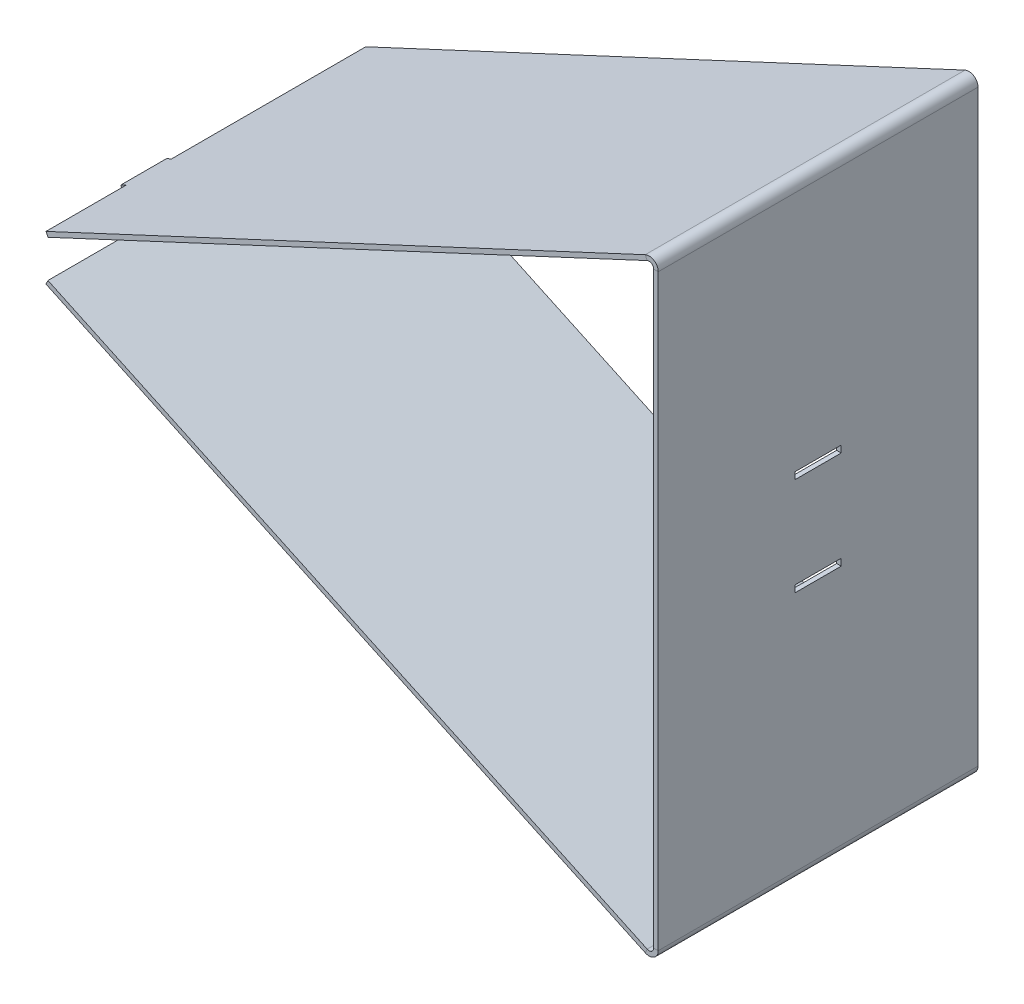
ISO-10303-21;
HEADER;
FILE_DESCRIPTION(('STEP AP214'),'2;1');
FILE_NAME('part.step','',(''),(''),'','','');
FILE_SCHEMA(('AUTOMOTIVE_DESIGN { 1 0 10303 214 1 1 1 1 }'));
ENDSEC;
DATA;
#1=APPLICATION_CONTEXT('core data for automotive mechanical design processes');
#2=APPLICATION_PROTOCOL_DEFINITION('international standard','automotive_design',2000,#1);
#3=PRODUCT_CONTEXT('',#1,'mechanical');
#4=PRODUCT('Part','Part','',(#3));
#5=PRODUCT_RELATED_PRODUCT_CATEGORY('part','',(#4));
#6=PRODUCT_DEFINITION_FORMATION('','',#4);
#7=PRODUCT_DEFINITION_CONTEXT('part definition',#1,'design');
#8=PRODUCT_DEFINITION('design','',#6,#7);
#9=PRODUCT_DEFINITION_SHAPE('','',#8);
#10=(LENGTH_UNIT() NAMED_UNIT(*) SI_UNIT(.MILLI.,.METRE.));
#11=(NAMED_UNIT(*) PLANE_ANGLE_UNIT() SI_UNIT($,.RADIAN.));
#12=(NAMED_UNIT(*) SI_UNIT($,.STERADIAN.) SOLID_ANGLE_UNIT());
#13=UNCERTAINTY_MEASURE_WITH_UNIT(LENGTH_MEASURE(1.E-05),#10,'distance_accuracy_value','');
#14=(GEOMETRIC_REPRESENTATION_CONTEXT(3) GLOBAL_UNCERTAINTY_ASSIGNED_CONTEXT((#13)) GLOBAL_UNIT_ASSIGNED_CONTEXT((#10,
#11,#12)) REPRESENTATION_CONTEXT('',''));
#15=CARTESIAN_POINT('',(0.,0.,0.));
#16=DIRECTION('',(0.,0.,1.));
#17=DIRECTION('',(1.,0.,0.));
#18=AXIS2_PLACEMENT_3D('',#15,#16,#17);
#19=CARTESIAN_POINT('',(372.91718723189,8.18738442592668,142.));
#20=DIRECTION('',(-0.906307787036641,-0.422618261740718,0.));
#21=DIRECTION('',(0.422618261740718,-0.906307787036641,0.));
#22=AXIS2_PLACEMENT_3D('',#19,#20,#21);
#23=PLANE('',#22);
#24=DIRECTION('',(0.,0.,-1.));
#25=VECTOR('',#24,1.);
#26=CARTESIAN_POINT('',(372.91718723189,8.18738442592668,142.));
#27=LINE('',#26,#25);
#28=CARTESIAN_POINT('',(372.91718723189,8.18738442592663,87.));
#29=VERTEX_POINT('',#28);
#30=CARTESIAN_POINT('',(372.91718723189,8.18738442592668,2.));
#31=VERTEX_POINT('',#30);
#32=EDGE_CURVE('E225',#29,#31,#27,.T.);
#33=ORIENTED_EDGE('',*,*,#32,.F.);
#34=DIRECTION('',(-0.422618261740699,0.90630778703665,0.));
#35=VECTOR('',#34,1.);
#36=CARTESIAN_POINT('',(372.91718723189,8.18738442592663,87.));
#37=LINE('',#36,#35);
#38=CARTESIAN_POINT('',(372.071950708408,9.99999999999999,87.));
#39=VERTEX_POINT('',#38);
#40=EDGE_CURVE('E232',#29,#39,#37,.T.);
#41=ORIENTED_EDGE('',*,*,#40,.T.);
#42=DIRECTION('',(0.,0.,-1.));
#43=VECTOR('',#42,1.);
#44=CARTESIAN_POINT('',(372.071950708408,9.99999999999999,142.));
#45=LINE('',#44,#43);
#46=CARTESIAN_POINT('',(372.071950708408,9.99999999999999,2.));
#47=VERTEX_POINT('',#46);
#48=EDGE_CURVE('E246',#39,#47,#45,.T.);
#49=ORIENTED_EDGE('',*,*,#48,.T.);
#50=DIRECTION('',(-0.422618261740718,0.906307787036641,0.));
#51=VECTOR('',#50,1.);
#52=CARTESIAN_POINT('',(372.91718723189,8.18738442592668,2.));
#53=LINE('',#52,#51);
#54=EDGE_CURVE('E240',#31,#47,#53,.T.);
#55=ORIENTED_EDGE('',*,*,#54,.F.);
#56=EDGE_LOOP('',(#33,#41,#49,#55));
#57=FACE_BOUND('',#56,.T.);
#58=ADVANCED_FACE('F36',(#57),#23,.T.);
#59=CARTESIAN_POINT('',(372.071950708408,-10.,142.));
#60=DIRECTION('',(-0.90630778703665,0.422618261740699,0.));
#61=DIRECTION('',(-0.422618261740699,-0.90630778703665,0.));
#62=AXIS2_PLACEMENT_3D('',#59,#60,#61);
#63=PLANE('',#62);
#64=DIRECTION('',(0.,0.,-1.));
#65=VECTOR('',#64,1.);
#66=CARTESIAN_POINT('',(372.91718723189,-8.18738442592671,142.));
#67=LINE('',#66,#65);
#68=CARTESIAN_POINT('',(372.91718723189,-8.18738442592671,142.));
#69=VERTEX_POINT('',#68);
#70=CARTESIAN_POINT('',(372.91718723189,-8.18738442592663,107.));
#71=VERTEX_POINT('',#70);
#72=EDGE_CURVE('E351',#69,#71,#67,.T.);
#73=ORIENTED_EDGE('',*,*,#72,.T.);
#74=DIRECTION('',(-0.422618261740699,-0.90630778703665,0.));
#75=VECTOR('',#74,1.);
#76=CARTESIAN_POINT('',(372.91718723189,-8.18738442592663,107.));
#77=LINE('',#76,#75);
#78=CARTESIAN_POINT('',(372.071950708408,-10.,107.));
#79=VERTEX_POINT('',#78);
#80=EDGE_CURVE('E408',#71,#79,#77,.T.);
#81=ORIENTED_EDGE('',*,*,#80,.T.);
#82=DIRECTION('',(0.,0.,-1.));
#83=VECTOR('',#82,1.);
#84=CARTESIAN_POINT('',(372.071950708408,-10.,142.));
#85=LINE('',#84,#83);
#86=CARTESIAN_POINT('',(372.071950708408,-10.,142.));
#87=VERTEX_POINT('',#86);
#88=EDGE_CURVE('E347',#87,#79,#85,.T.);
#89=ORIENTED_EDGE('',*,*,#88,.F.);
#90=DIRECTION('',(0.422618261740698,0.90630778703665,0.));
#91=VECTOR('',#90,1.);
#92=CARTESIAN_POINT('',(372.071950708408,-10.,142.));
#93=LINE('',#92,#91);
#94=EDGE_CURVE('E382',#87,#69,#93,.T.);
#95=ORIENTED_EDGE('',*,*,#94,.T.);
#96=EDGE_LOOP('',(#73,#81,#89,#95));
#97=FACE_BOUND('',#96,.T.);
#98=ADVANCED_FACE('F406',(#97),#63,.T.);
#99=CARTESIAN_POINT('',(634.44484272514,-132.346488839677,142.));
#100=DIRECTION('',(0.,0.,1.));
#101=DIRECTION('',(1.,0.,0.));
#102=AXIS2_PLACEMENT_3D('',#99,#100,#101);
#103=PLANE('',#102);
#104=DIRECTION('',(0.422618261740725,0.906307787036638,0.));
#105=VECTOR('',#104,1.);
#106=CARTESIAN_POINT('',(634.44484272514,-132.346488839677,142.));
#107=LINE('',#106,#105);
#108=CARTESIAN_POINT('',(634.44484272514,-132.346488839677,142.));
#109=VERTEX_POINT('',#108);
#110=CARTESIAN_POINT('',(635.290079248622,-130.533873265603,142.));
#111=VERTEX_POINT('',#110);
#112=EDGE_CURVE('E11',#109,#111,#107,.T.);
#113=ORIENTED_EDGE('',*,*,#112,.F.);
#114=CARTESIAN_POINT('',(636.135315772103,-128.72125769153,142.));
#115=DIRECTION('',(0.,0.,-1.));
#116=DIRECTION('',(-1.,0.,0.));
#117=AXIS2_PLACEMENT_3D('',#114,#115,#116);
#118=CIRCLE('',#117,4.);
#119=CARTESIAN_POINT('',(640.135315772103,-128.72125769153,142.));
#120=VERTEX_POINT('',#119);
#121=EDGE_CURVE('E281',#109,#120,#118,.F.);
#122=ORIENTED_EDGE('',*,*,#121,.T.);
#123=DIRECTION('',(1.,0.,0.));
#124=VECTOR('',#123,1.);
#125=CARTESIAN_POINT('',(638.135315772103,-128.72125769153,142.));
#126=LINE('',#125,#124);
#127=CARTESIAN_POINT('',(638.135315772103,-128.72125769153,142.));
#128=VERTEX_POINT('',#127);
#129=EDGE_CURVE('E44',#128,#120,#126,.T.);
#130=ORIENTED_EDGE('',*,*,#129,.F.);
#131=CARTESIAN_POINT('',(636.135315772103,-128.72125769153,142.));
#132=DIRECTION('',(0.,0.,1.));
#133=DIRECTION('',(1.,0.,0.));
#134=AXIS2_PLACEMENT_3D('',#131,#132,#133);
#135=CIRCLE('',#134,2.);
#136=EDGE_CURVE('E378',#111,#128,#135,.T.);
#137=ORIENTED_EDGE('',*,*,#136,.F.);
#138=EDGE_LOOP('',(#113,#122,#130,#137));
#139=FACE_BOUND('',#138,.T.);
#140=ADVANCED_FACE('F38',(#139),#103,.T.);
#141=CARTESIAN_POINT('',(638.135315772103,-128.72125769153,142.));
#142=DIRECTION('',(0.,0.,1.));
#143=DIRECTION('',(1.,0.,0.));
#144=AXIS2_PLACEMENT_3D('',#141,#142,#143);
#145=PLANE('',#144);
#146=DIRECTION('',(0.90630778703665,-0.4226182617407,0.));
#147=VECTOR('',#146,1.);
#148=CARTESIAN_POINT('',(372.071950708408,-10.,142.));
#149=LINE('',#148,#147);
#150=EDGE_CURVE('E286',#87,#109,#149,.T.);
#151=ORIENTED_EDGE('',*,*,#150,.T.);
#152=ORIENTED_EDGE('',*,*,#112,.T.);
#153=DIRECTION('',(0.90630778703665,-0.4226182617407,0.));
#154=VECTOR('',#153,1.);
#155=CARTESIAN_POINT('',(372.91718723189,-8.18738442592671,142.));
#156=LINE('',#155,#154);
#157=EDGE_CURVE('E380',#69,#111,#156,.T.);
#158=ORIENTED_EDGE('',*,*,#157,.F.);
#159=ORIENTED_EDGE('',*,*,#94,.F.);
#160=EDGE_LOOP('',(#151,#152,#158,#159));
#161=FACE_BOUND('',#160,.T.);
#162=ADVANCED_FACE('F393',(#161),#145,.T.);
#163=CARTESIAN_POINT('',(640.135315772103,-128.72125769153,2.));
#164=DIRECTION('',(0.,0.,-1.));
#165=DIRECTION('',(-1.,0.,0.));
#166=AXIS2_PLACEMENT_3D('',#163,#164,#165);
#167=PLANE('',#166);
#168=DIRECTION('',(-1.,0.,0.));
#169=VECTOR('',#168,1.);
#170=CARTESIAN_POINT('',(640.135315772103,-128.72125769153,2.));
#171=LINE('',#170,#169);
#172=CARTESIAN_POINT('',(640.135315772103,-128.72125769153,2.));
#173=VERTEX_POINT('',#172);
#174=CARTESIAN_POINT('',(638.135315772103,-128.72125769153,2.));
#175=VERTEX_POINT('',#174);
#176=EDGE_CURVE('E265',#173,#175,#171,.T.);
#177=ORIENTED_EDGE('',*,*,#176,.F.);
#178=CARTESIAN_POINT('',(636.135315772103,-128.72125769153,2.));
#179=DIRECTION('',(0.,0.,-1.));
#180=DIRECTION('',(-1.,0.,0.));
#181=AXIS2_PLACEMENT_3D('',#178,#179,#180);
#182=CIRCLE('',#181,4.);
#183=CARTESIAN_POINT('',(634.44484272514,-132.346488839677,2.));
#184=VERTEX_POINT('',#183);
#185=EDGE_CURVE('E293',#184,#173,#182,.F.);
#186=ORIENTED_EDGE('',*,*,#185,.F.);
#187=DIRECTION('',(-0.422618261740725,-0.906307787036638,0.));
#188=VECTOR('',#187,1.);
#189=CARTESIAN_POINT('',(635.290079248622,-130.533873265603,2.));
#190=LINE('',#189,#188);
#191=CARTESIAN_POINT('',(635.290079248622,-130.533873265603,2.));
#192=VERTEX_POINT('',#191);
#193=EDGE_CURVE('E263',#192,#184,#190,.T.);
#194=ORIENTED_EDGE('',*,*,#193,.F.);
#195=CARTESIAN_POINT('',(636.135315772103,-128.72125769153,2.));
#196=DIRECTION('',(0.,0.,1.));
#197=DIRECTION('',(1.,0.,0.));
#198=AXIS2_PLACEMENT_3D('',#195,#196,#197);
#199=CIRCLE('',#198,2.);
#200=EDGE_CURVE('E323',#192,#175,#199,.T.);
#201=ORIENTED_EDGE('',*,*,#200,.T.);
#202=EDGE_LOOP('',(#177,#186,#194,#201));
#203=FACE_BOUND('',#202,.T.);
#204=ADVANCED_FACE('F398',(#203),#167,.T.);
#205=CARTESIAN_POINT('',(635.290079248622,-130.533873265603,2.));
#206=DIRECTION('',(0.,0.,-1.));
#207=DIRECTION('',(-1.,0.,0.));
#208=AXIS2_PLACEMENT_3D('',#205,#206,#207);
#209=PLANE('',#208);
#210=DIRECTION('',(0.,1.,0.));
#211=VECTOR('',#210,1.);
#212=CARTESIAN_POINT('',(640.135315772103,-135.,2.));
#213=LINE('',#212,#211);
#214=CARTESIAN_POINT('',(640.135315772103,128.72125769153,2.));
#215=VERTEX_POINT('',#214);
#216=EDGE_CURVE('E336',#173,#215,#213,.T.);
#217=ORIENTED_EDGE('',*,*,#216,.F.);
#218=ORIENTED_EDGE('',*,*,#176,.T.);
#219=DIRECTION('',(0.,1.,0.));
#220=VECTOR('',#219,1.);
#221=CARTESIAN_POINT('',(638.135315772103,-135.,2.));
#222=LINE('',#221,#220);
#223=CARTESIAN_POINT('',(638.135315772103,128.72125769153,2.));
#224=VERTEX_POINT('',#223);
#225=EDGE_CURVE('E320',#175,#224,#222,.T.);
#226=ORIENTED_EDGE('',*,*,#225,.T.);
#227=DIRECTION('',(1.,0.,0.));
#228=VECTOR('',#227,1.);
#229=CARTESIAN_POINT('',(638.135315772103,128.72125769153,2.));
#230=LINE('',#229,#228);
#231=EDGE_CURVE('E255',#224,#215,#230,.T.);
#232=ORIENTED_EDGE('',*,*,#231,.T.);
#233=EDGE_LOOP('',(#217,#218,#226,#232));
#234=FACE_BOUND('',#233,.T.);
#235=ADVANCED_FACE('F372',(#234),#209,.T.);
#236=CARTESIAN_POINT('',(640.135315772103,128.72125769153,142.));
#237=DIRECTION('',(0.,0.,1.));
#238=DIRECTION('',(1.,0.,0.));
#239=AXIS2_PLACEMENT_3D('',#236,#237,#238);
#240=PLANE('',#239);
#241=DIRECTION('',(-1.,0.,0.));
#242=VECTOR('',#241,1.);
#243=CARTESIAN_POINT('',(640.135315772103,128.72125769153,142.));
#244=LINE('',#243,#242);
#245=CARTESIAN_POINT('',(640.135315772103,128.72125769153,142.));
#246=VERTEX_POINT('',#245);
#247=CARTESIAN_POINT('',(638.135315772103,128.72125769153,142.));
#248=VERTEX_POINT('',#247);
#249=EDGE_CURVE('E261',#246,#248,#244,.T.);
#250=ORIENTED_EDGE('',*,*,#249,.F.);
#251=CARTESIAN_POINT('',(636.135315772103,128.72125769153,142.));
#252=DIRECTION('',(0.,0.,-1.));
#253=DIRECTION('',(-1.,0.,0.));
#254=AXIS2_PLACEMENT_3D('',#251,#252,#253);
#255=CIRCLE('',#254,4.);
#256=CARTESIAN_POINT('',(634.44484272514,132.346488839677,142.));
#257=VERTEX_POINT('',#256);
#258=EDGE_CURVE('E303',#246,#257,#255,.F.);
#259=ORIENTED_EDGE('',*,*,#258,.T.);
#260=DIRECTION('',(-0.42261826174072,0.90630778703664,0.));
#261=VECTOR('',#260,1.);
#262=CARTESIAN_POINT('',(635.290079248622,130.533873265603,142.));
#263=LINE('',#262,#261);
#264=CARTESIAN_POINT('',(635.290079248622,130.533873265603,142.));
#265=VERTEX_POINT('',#264);
#266=EDGE_CURVE('E259',#265,#257,#263,.T.);
#267=ORIENTED_EDGE('',*,*,#266,.F.);
#268=CARTESIAN_POINT('',(636.135315772103,128.72125769153,142.));
#269=DIRECTION('',(0.,0.,1.));
#270=DIRECTION('',(1.,0.,0.));
#271=AXIS2_PLACEMENT_3D('',#268,#269,#270);
#272=CIRCLE('',#271,2.);
#273=EDGE_CURVE('E384',#248,#265,#272,.T.);
#274=ORIENTED_EDGE('',*,*,#273,.F.);
#275=EDGE_LOOP('',(#250,#259,#267,#274));
#276=FACE_BOUND('',#275,.T.);
#277=ADVANCED_FACE('F442',(#276),#240,.T.);
#278=CARTESIAN_POINT('',(635.290079248622,130.533873265603,142.));
#279=DIRECTION('',(0.,0.,1.));
#280=DIRECTION('',(1.,0.,0.));
#281=AXIS2_PLACEMENT_3D('',#278,#279,#280);
#282=PLANE('',#281);
#283=DIRECTION('',(0.,1.,0.));
#284=VECTOR('',#283,1.);
#285=CARTESIAN_POINT('',(640.135315772103,-135.,142.));
#286=LINE('',#285,#284);
#287=EDGE_CURVE('E272',#120,#246,#286,.T.);
#288=ORIENTED_EDGE('',*,*,#287,.T.);
#289=ORIENTED_EDGE('',*,*,#249,.T.);
#290=DIRECTION('',(0.,1.,0.));
#291=VECTOR('',#290,1.);
#292=CARTESIAN_POINT('',(638.135315772103,-135.,142.));
#293=LINE('',#292,#291);
#294=EDGE_CURVE('E275',#128,#248,#293,.T.);
#295=ORIENTED_EDGE('',*,*,#294,.F.);
#296=ORIENTED_EDGE('',*,*,#129,.T.);
#297=EDGE_LOOP('',(#288,#289,#295,#296));
#298=FACE_BOUND('',#297,.T.);
#299=ADVANCED_FACE('F270',(#298),#282,.T.);
#300=CARTESIAN_POINT('',(634.44484272514,132.346488839677,2.));
#301=DIRECTION('',(0.,0.,-1.));
#302=DIRECTION('',(-1.,0.,0.));
#303=AXIS2_PLACEMENT_3D('',#300,#301,#302);
#304=PLANE('',#303);
#305=DIRECTION('',(0.42261826174072,-0.90630778703664,0.));
#306=VECTOR('',#305,1.);
#307=CARTESIAN_POINT('',(634.44484272514,132.346488839677,2.));
#308=LINE('',#307,#306);
#309=CARTESIAN_POINT('',(634.44484272514,132.346488839677,2.));
#310=VERTEX_POINT('',#309);
#311=CARTESIAN_POINT('',(635.290079248622,130.533873265603,2.));
#312=VERTEX_POINT('',#311);
#313=EDGE_CURVE('E257',#310,#312,#308,.T.);
#314=ORIENTED_EDGE('',*,*,#313,.F.);
#315=CARTESIAN_POINT('',(636.135315772103,128.72125769153,2.));
#316=DIRECTION('',(0.,0.,-1.));
#317=DIRECTION('',(-1.,0.,0.));
#318=AXIS2_PLACEMENT_3D('',#315,#316,#317);
#319=CIRCLE('',#318,4.);
#320=EDGE_CURVE('E338',#215,#310,#319,.F.);
#321=ORIENTED_EDGE('',*,*,#320,.F.);
#322=ORIENTED_EDGE('',*,*,#231,.F.);
#323=CARTESIAN_POINT('',(636.135315772103,128.72125769153,2.));
#324=DIRECTION('',(0.,0.,1.));
#325=DIRECTION('',(1.,0.,0.));
#326=AXIS2_PLACEMENT_3D('',#323,#324,#325);
#327=CIRCLE('',#326,2.);
#328=EDGE_CURVE('E317',#224,#312,#327,.T.);
#329=ORIENTED_EDGE('',*,*,#328,.T.);
#330=EDGE_LOOP('',(#314,#321,#322,#329));
#331=FACE_BOUND('',#330,.T.);
#332=ADVANCED_FACE('F576',(#331),#304,.T.);
#333=CARTESIAN_POINT('',(638.135315772103,128.72125769153,2.));
#334=DIRECTION('',(0.,0.,-1.));
#335=DIRECTION('',(-1.,0.,0.));
#336=AXIS2_PLACEMENT_3D('',#333,#334,#335);
#337=PLANE('',#336);
#338=DIRECTION('',(-0.90630778703665,-0.4226182617407,0.));
#339=VECTOR('',#338,1.);
#340=CARTESIAN_POINT('',(640.135315772103,135.,2.));
#341=LINE('',#340,#339);
#342=EDGE_CURVE('E310',#310,#47,#341,.T.);
#343=ORIENTED_EDGE('',*,*,#342,.F.);
#344=ORIENTED_EDGE('',*,*,#313,.T.);
#345=DIRECTION('',(-0.90630778703665,-0.4226182617407,0.));
#346=VECTOR('',#345,1.);
#347=CARTESIAN_POINT('',(640.980552295585,133.187384425927,2.));
#348=LINE('',#347,#346);
#349=EDGE_CURVE('E315',#312,#31,#348,.T.);
#350=ORIENTED_EDGE('',*,*,#349,.T.);
#351=ORIENTED_EDGE('',*,*,#54,.T.);
#352=EDGE_LOOP('',(#343,#344,#350,#351));
#353=FACE_BOUND('',#352,.T.);
#354=ADVANCED_FACE('F571',(#353),#337,.T.);
#355=CARTESIAN_POINT('',(640.135315772103,135.,142.));
#356=DIRECTION('',(0.4226182617407,-0.90630778703665,0.));
#357=DIRECTION('',(0.90630778703665,0.4226182617407,0.));
#358=AXIS2_PLACEMENT_3D('',#355,#356,#357);
#359=PLANE('',#358);
#360=ORIENTED_EDGE('',*,*,#342,.T.);
#361=ORIENTED_EDGE('',*,*,#48,.F.);
#362=DIRECTION('',(0.906307787036651,0.422618261740697,0.));
#363=VECTOR('',#362,1.);
#364=CARTESIAN_POINT('',(372.071950708408,9.99999999999993,87.));
#365=LINE('',#364,#363);
#366=CARTESIAN_POINT('',(369.806181240817,8.94345434564819,87.));
#367=VERTEX_POINT('',#366);
#368=EDGE_CURVE('E51',#367,#39,#365,.T.);
#369=ORIENTED_EDGE('',*,*,#368,.F.);
#370=DIRECTION('',(0.,0.,-1.));
#371=VECTOR('',#370,1.);
#372=CARTESIAN_POINT('',(369.806181240817,8.94345434564819,107.));
#373=LINE('',#372,#371);
#374=CARTESIAN_POINT('',(369.806181240817,8.94345434564819,107.));
#375=VERTEX_POINT('',#374);
#376=EDGE_CURVE('E468',#375,#367,#373,.T.);
#377=ORIENTED_EDGE('',*,*,#376,.F.);
#378=DIRECTION('',(-0.906307787036651,-0.422618261740697,0.));
#379=VECTOR('',#378,1.);
#380=CARTESIAN_POINT('',(372.071950708408,9.99999999999993,107.));
#381=LINE('',#380,#379);
#382=CARTESIAN_POINT('',(372.071950708408,9.99999999999993,107.));
#383=VERTEX_POINT('',#382);
#384=EDGE_CURVE('E230',#383,#375,#381,.T.);
#385=ORIENTED_EDGE('',*,*,#384,.F.);
#386=CARTESIAN_POINT('',(372.071950708408,9.99999999999999,142.));
#387=VERTEX_POINT('',#386);
#388=EDGE_CURVE('E252',#387,#383,#45,.T.);
#389=ORIENTED_EDGE('',*,*,#388,.F.);
#390=DIRECTION('',(-0.90630778703665,-0.4226182617407,0.));
#391=VECTOR('',#390,1.);
#392=CARTESIAN_POINT('',(640.135315772103,135.,142.));
#393=LINE('',#392,#391);
#394=EDGE_CURVE('E341',#257,#387,#393,.T.);
#395=ORIENTED_EDGE('',*,*,#394,.F.);
#396=DIRECTION('',(0.,0.,-1.));
#397=VECTOR('',#396,1.);
#398=CARTESIAN_POINT('',(634.44484272514,132.346488839677,142.));
#399=LINE('',#398,#397);
#400=EDGE_CURVE('E306',#257,#310,#399,.T.);
#401=ORIENTED_EDGE('',*,*,#400,.T.);
#402=EDGE_LOOP('',(#360,#361,#369,#377,#385,#389,#395,#401));
#403=FACE_BOUND('',#402,.T.);
#404=ADVANCED_FACE('F566',(#403),#359,.F.);
#405=DIRECTION('',(-0.422618261740699,0.90630778703665,0.));
#406=VECTOR('',#405,1.);
#407=CARTESIAN_POINT('',(372.91718723189,8.18738442592663,107.));
#408=LINE('',#407,#406);
#409=CARTESIAN_POINT('',(372.91718723189,8.18738442592663,107.));
#410=VERTEX_POINT('',#409);
#411=EDGE_CURVE('E454',#410,#383,#408,.T.);
#412=ORIENTED_EDGE('',*,*,#411,.F.);
#413=CARTESIAN_POINT('',(372.91718723189,8.18738442592668,142.));
#414=VERTEX_POINT('',#413);
#415=EDGE_CURVE('E242',#414,#410,#27,.T.);
#416=ORIENTED_EDGE('',*,*,#415,.F.);
#417=DIRECTION('',(-0.422618261740718,0.906307787036641,0.));
#418=VECTOR('',#417,1.);
#419=CARTESIAN_POINT('',(372.91718723189,8.18738442592668,142.));
#420=LINE('',#419,#418);
#421=EDGE_CURVE('E436',#414,#387,#420,.T.);
#422=ORIENTED_EDGE('',*,*,#421,.T.);
#423=ORIENTED_EDGE('',*,*,#388,.T.);
#424=EDGE_LOOP('',(#412,#416,#422,#423));
#425=FACE_BOUND('',#424,.T.);
#426=ADVANCED_FACE('F452',(#425),#23,.T.);
#427=CARTESIAN_POINT('',(640.980552295585,133.187384425927,142.));
#428=DIRECTION('',(0.4226182617407,-0.90630778703665,0.));
#429=DIRECTION('',(0.90630778703665,0.4226182617407,0.));
#430=AXIS2_PLACEMENT_3D('',#427,#428,#429);
#431=PLANE('',#430);
#432=ORIENTED_EDGE('',*,*,#349,.F.);
#433=DIRECTION('',(0.,0.,-1.));
#434=VECTOR('',#433,1.);
#435=CARTESIAN_POINT('',(635.290079248622,130.533873265603,142.));
#436=LINE('',#435,#434);
#437=EDGE_CURVE('E243',#265,#312,#436,.T.);
#438=ORIENTED_EDGE('',*,*,#437,.F.);
#439=DIRECTION('',(-0.90630778703665,-0.4226182617407,0.));
#440=VECTOR('',#439,1.);
#441=CARTESIAN_POINT('',(640.980552295585,133.187384425927,142.));
#442=LINE('',#441,#440);
#443=EDGE_CURVE('E439',#265,#414,#442,.T.);
#444=ORIENTED_EDGE('',*,*,#443,.T.);
#445=ORIENTED_EDGE('',*,*,#415,.T.);
#446=DIRECTION('',(-0.906307787036651,-0.422618261740697,0.));
#447=VECTOR('',#446,1.);
#448=CARTESIAN_POINT('',(372.91718723189,8.18738442592663,107.));
#449=LINE('',#448,#447);
#450=CARTESIAN_POINT('',(370.651417764298,7.13083877157489,107.));
#451=VERTEX_POINT('',#450);
#452=EDGE_CURVE('E237',#410,#451,#449,.T.);
#453=ORIENTED_EDGE('',*,*,#452,.T.);
#454=DIRECTION('',(0.,0.,-1.));
#455=VECTOR('',#454,1.);
#456=CARTESIAN_POINT('',(370.651417764298,7.13083877157489,107.));
#457=LINE('',#456,#455);
#458=CARTESIAN_POINT('',(370.651417764298,7.13083877157489,87.));
#459=VERTEX_POINT('',#458);
#460=EDGE_CURVE('E228',#451,#459,#457,.T.);
#461=ORIENTED_EDGE('',*,*,#460,.T.);
#462=DIRECTION('',(0.906307787036651,0.422618261740697,0.));
#463=VECTOR('',#462,1.);
#464=CARTESIAN_POINT('',(372.91718723189,8.18738442592663,87.));
#465=LINE('',#464,#463);
#466=EDGE_CURVE('E221',#459,#29,#465,.T.);
#467=ORIENTED_EDGE('',*,*,#466,.T.);
#468=ORIENTED_EDGE('',*,*,#32,.T.);
#469=EDGE_LOOP('',(#432,#438,#444,#445,#453,#461,#467,#468));
#470=FACE_BOUND('',#469,.T.);
#471=ADVANCED_FACE('F223',(#470),#431,.T.);
#472=CARTESIAN_POINT('',(636.135315772103,128.72125769153,142.));
#473=DIRECTION('',(0.,0.,-1.));
#474=DIRECTION('',(-1.,0.,0.));
#475=AXIS2_PLACEMENT_3D('',#472,#473,#474);
#476=CYLINDRICAL_SURFACE('',#475,2.);
#477=ORIENTED_EDGE('',*,*,#328,.F.);
#478=DIRECTION('',(0.,0.,-1.));
#479=VECTOR('',#478,1.);
#480=CARTESIAN_POINT('',(638.135315772103,128.72125769153,142.));
#481=LINE('',#480,#479);
#482=EDGE_CURVE('E248',#248,#224,#481,.T.);
#483=ORIENTED_EDGE('',*,*,#482,.F.);
#484=ORIENTED_EDGE('',*,*,#273,.T.);
#485=ORIENTED_EDGE('',*,*,#437,.T.);
#486=EDGE_LOOP('',(#477,#483,#484,#485));
#487=FACE_BOUND('',#486,.T.);
#488=ADVANCED_FACE('F368',(#487),#476,.F.);
#489=CARTESIAN_POINT('',(638.135315772103,-135.,142.));
#490=DIRECTION('',(-1.,0.,0.));
#491=DIRECTION('',(0.,0.,1.));
#492=AXIS2_PLACEMENT_3D('',#489,#490,#491);
#493=PLANE('',#492);
#494=DIRECTION('',(0.,-1.,0.));
#495=VECTOR('',#494,1.);
#496=CARTESIAN_POINT('',(638.135315772103,-19.9534570333156,82.1));
#497=LINE('',#496,#495);
#498=CARTESIAN_POINT('',(638.135315772103,-19.9534570333156,82.1));
#499=VERTEX_POINT('',#498);
#500=CARTESIAN_POINT('',(638.135315772103,-22.9534570333156,82.1));
#501=VERTEX_POINT('',#500);
#502=EDGE_CURVE('E474',#499,#501,#497,.T.);
#503=ORIENTED_EDGE('',*,*,#502,.T.);
#504=DIRECTION('',(0.,0.,-1.));
#505=VECTOR('',#504,1.);
#506=CARTESIAN_POINT('',(638.135315772103,-22.9534570333156,82.1));
#507=LINE('',#506,#505);
#508=CARTESIAN_POINT('',(638.135315772103,-22.9534570333156,61.9));
#509=VERTEX_POINT('',#508);
#510=EDGE_CURVE('E477',#501,#509,#507,.T.);
#511=ORIENTED_EDGE('',*,*,#510,.T.);
#512=DIRECTION('',(0.,1.,0.));
#513=VECTOR('',#512,1.);
#514=CARTESIAN_POINT('',(638.135315772103,-19.9534570333156,61.9));
#515=LINE('',#514,#513);
#516=CARTESIAN_POINT('',(638.135315772103,-19.9534570333156,61.9));
#517=VERTEX_POINT('',#516);
#518=EDGE_CURVE('E59',#509,#517,#515,.T.);
#519=ORIENTED_EDGE('',*,*,#518,.T.);
#520=DIRECTION('',(0.,0.,1.));
#521=VECTOR('',#520,1.);
#522=CARTESIAN_POINT('',(638.135315772103,-19.9534570333156,82.1));
#523=LINE('',#522,#521);
#524=EDGE_CURVE('E482',#517,#499,#523,.T.);
#525=ORIENTED_EDGE('',*,*,#524,.T.);
#526=EDGE_LOOP('',(#503,#511,#519,#525));
#527=FACE_BOUND('',#526,.T.);
#528=DIRECTION('',(0.,0.,-1.));
#529=VECTOR('',#528,1.);
#530=CARTESIAN_POINT('',(638.135315772103,19.9534570333156,82.1));
#531=LINE('',#530,#529);
#532=CARTESIAN_POINT('',(638.135315772103,19.9534570333156,82.1));
#533=VERTEX_POINT('',#532);
#534=CARTESIAN_POINT('',(638.135315772103,19.9534570333156,61.9));
#535=VERTEX_POINT('',#534);
#536=EDGE_CURVE('E502',#533,#535,#531,.T.);
#537=ORIENTED_EDGE('',*,*,#536,.T.);
#538=DIRECTION('',(0.,1.,0.));
#539=VECTOR('',#538,1.);
#540=CARTESIAN_POINT('',(638.135315772103,19.9534570333156,61.9));
#541=LINE('',#540,#539);
#542=CARTESIAN_POINT('',(638.135315772103,22.9534570333156,61.9));
#543=VERTEX_POINT('',#542);
#544=EDGE_CURVE('E505',#535,#543,#541,.T.);
#545=ORIENTED_EDGE('',*,*,#544,.T.);
#546=DIRECTION('',(0.,0.,1.));
#547=VECTOR('',#546,1.);
#548=CARTESIAN_POINT('',(638.135315772103,22.9534570333156,82.1));
#549=LINE('',#548,#547);
#550=CARTESIAN_POINT('',(638.135315772103,22.9534570333156,82.1));
#551=VERTEX_POINT('',#550);
#552=EDGE_CURVE('E509',#543,#551,#549,.T.);
#553=ORIENTED_EDGE('',*,*,#552,.T.);
#554=DIRECTION('',(0.,-1.,0.));
#555=VECTOR('',#554,1.);
#556=CARTESIAN_POINT('',(638.135315772103,19.9534570333156,82.1));
#557=LINE('',#556,#555);
#558=EDGE_CURVE('E512',#551,#533,#557,.T.);
#559=ORIENTED_EDGE('',*,*,#558,.T.);
#560=EDGE_LOOP('',(#537,#545,#553,#559));
#561=FACE_BOUND('',#560,.T.);
#562=ORIENTED_EDGE('',*,*,#225,.F.);
#563=DIRECTION('',(0.,0.,-1.));
#564=VECTOR('',#563,1.);
#565=CARTESIAN_POINT('',(638.135315772103,-128.72125769153,142.));
#566=LINE('',#565,#564);
#567=EDGE_CURVE('E357',#128,#175,#566,.T.);
#568=ORIENTED_EDGE('',*,*,#567,.F.);
#569=ORIENTED_EDGE('',*,*,#294,.T.);
#570=ORIENTED_EDGE('',*,*,#482,.T.);
#571=EDGE_LOOP('',(#562,#568,#569,#570));
#572=FACE_BOUND('',#571,.T.);
#573=ADVANCED_FACE('F364',(#527,#561,#572),#493,.T.);
#574=CARTESIAN_POINT('',(636.135315772103,-128.72125769153,142.));
#575=DIRECTION('',(0.,0.,-1.));
#576=DIRECTION('',(-1.,0.,0.));
#577=AXIS2_PLACEMENT_3D('',#574,#575,#576);
#578=CYLINDRICAL_SURFACE('',#577,2.);
#579=ORIENTED_EDGE('',*,*,#200,.F.);
#580=DIRECTION('',(0.,0.,-1.));
#581=VECTOR('',#580,1.);
#582=CARTESIAN_POINT('',(635.290079248622,-130.533873265603,142.));
#583=LINE('',#582,#581);
#584=EDGE_CURVE('E354',#111,#192,#583,.T.);
#585=ORIENTED_EDGE('',*,*,#584,.F.);
#586=ORIENTED_EDGE('',*,*,#136,.T.);
#587=ORIENTED_EDGE('',*,*,#567,.T.);
#588=EDGE_LOOP('',(#579,#585,#586,#587));
#589=FACE_BOUND('',#588,.T.);
#590=ADVANCED_FACE('F376',(#589),#578,.F.);
#591=CARTESIAN_POINT('',(372.91718723189,-8.18738442592671,142.));
#592=DIRECTION('',(0.4226182617407,0.90630778703665,0.));
#593=DIRECTION('',(-0.90630778703665,0.4226182617407,0.));
#594=AXIS2_PLACEMENT_3D('',#591,#592,#593);
#595=PLANE('',#594);
#596=DIRECTION('',(0.90630778703665,-0.4226182617407,0.));
#597=VECTOR('',#596,1.);
#598=CARTESIAN_POINT('',(372.91718723189,-8.18738442592671,2.));
#599=LINE('',#598,#597);
#600=CARTESIAN_POINT('',(372.91718723189,-8.18738442592671,2.));
#601=VERTEX_POINT('',#600);
#602=EDGE_CURVE('E326',#601,#192,#599,.T.);
#603=ORIENTED_EDGE('',*,*,#602,.F.);
#604=CARTESIAN_POINT('',(372.91718723189,-8.18738442592663,87.));
#605=VERTEX_POINT('',#604);
#606=EDGE_CURVE('E350',#605,#601,#67,.T.);
#607=ORIENTED_EDGE('',*,*,#606,.F.);
#608=DIRECTION('',(0.906307787036651,-0.422618261740697,0.));
#609=VECTOR('',#608,1.);
#610=CARTESIAN_POINT('',(372.91718723189,-8.18738442592663,87.));
#611=LINE('',#610,#609);
#612=CARTESIAN_POINT('',(370.651417764298,-7.13083877157489,87.));
#613=VERTEX_POINT('',#612);
#614=EDGE_CURVE('E424',#613,#605,#611,.T.);
#615=ORIENTED_EDGE('',*,*,#614,.F.);
#616=DIRECTION('',(0.,0.,-1.));
#617=VECTOR('',#616,1.);
#618=CARTESIAN_POINT('',(370.651417764298,-7.13083877157489,107.));
#619=LINE('',#618,#617);
#620=CARTESIAN_POINT('',(370.651417764298,-7.13083877157489,107.));
#621=VERTEX_POINT('',#620);
#622=EDGE_CURVE('E533',#621,#613,#619,.T.);
#623=ORIENTED_EDGE('',*,*,#622,.F.);
#624=DIRECTION('',(-0.906307787036651,0.422618261740697,0.));
#625=VECTOR('',#624,1.);
#626=CARTESIAN_POINT('',(372.91718723189,-8.18738442592663,107.));
#627=LINE('',#626,#625);
#628=EDGE_CURVE('E428',#71,#621,#627,.T.);
#629=ORIENTED_EDGE('',*,*,#628,.F.);
#630=ORIENTED_EDGE('',*,*,#72,.F.);
#631=ORIENTED_EDGE('',*,*,#157,.T.);
#632=ORIENTED_EDGE('',*,*,#584,.T.);
#633=EDGE_LOOP('',(#603,#607,#615,#623,#629,#630,#631,#632));
#634=FACE_BOUND('',#633,.T.);
#635=ADVANCED_FACE('F402',(#634),#595,.T.);
#636=DIRECTION('',(-0.422618261740699,-0.90630778703665,0.));
#637=VECTOR('',#636,1.);
#638=CARTESIAN_POINT('',(372.91718723189,-8.18738442592663,87.));
#639=LINE('',#638,#637);
#640=CARTESIAN_POINT('',(372.071950708408,-9.99999999999993,87.));
#641=VERTEX_POINT('',#640);
#642=EDGE_CURVE('E313',#605,#641,#639,.T.);
#643=ORIENTED_EDGE('',*,*,#642,.F.);
#644=ORIENTED_EDGE('',*,*,#606,.T.);
#645=DIRECTION('',(0.422618261740698,0.90630778703665,0.));
#646=VECTOR('',#645,1.);
#647=CARTESIAN_POINT('',(372.071950708408,-10.,2.));
#648=LINE('',#647,#646);
#649=CARTESIAN_POINT('',(372.071950708408,-10.,2.));
#650=VERTEX_POINT('',#649);
#651=EDGE_CURVE('E329',#650,#601,#648,.T.);
#652=ORIENTED_EDGE('',*,*,#651,.F.);
#653=EDGE_CURVE('E346',#641,#650,#85,.T.);
#654=ORIENTED_EDGE('',*,*,#653,.F.);
#655=EDGE_LOOP('',(#643,#644,#652,#654));
#656=FACE_BOUND('',#655,.T.);
#657=ADVANCED_FACE('F543',(#656),#63,.T.);
#658=CARTESIAN_POINT('',(372.071950708408,-10.,142.));
#659=DIRECTION('',(0.4226182617407,0.90630778703665,0.));
#660=DIRECTION('',(-0.90630778703665,0.4226182617407,0.));
#661=AXIS2_PLACEMENT_3D('',#658,#659,#660);
#662=PLANE('',#661);
#663=DIRECTION('',(0.90630778703665,-0.4226182617407,0.));
#664=VECTOR('',#663,1.);
#665=CARTESIAN_POINT('',(372.071950708408,-10.,2.));
#666=LINE('',#665,#664);
#667=EDGE_CURVE('E332',#650,#184,#666,.T.);
#668=ORIENTED_EDGE('',*,*,#667,.T.);
#669=DIRECTION('',(0.,0.,-1.));
#670=VECTOR('',#669,1.);
#671=CARTESIAN_POINT('',(634.44484272514,-132.346488839677,142.));
#672=LINE('',#671,#670);
#673=EDGE_CURVE('E297',#109,#184,#672,.T.);
#674=ORIENTED_EDGE('',*,*,#673,.F.);
#675=ORIENTED_EDGE('',*,*,#150,.F.);
#676=ORIENTED_EDGE('',*,*,#88,.T.);
#677=DIRECTION('',(-0.906307787036651,0.422618261740697,0.));
#678=VECTOR('',#677,1.);
#679=CARTESIAN_POINT('',(372.071950708408,-9.99999999999993,107.));
#680=LINE('',#679,#678);
#681=CARTESIAN_POINT('',(369.806181240817,-8.94345434564819,107.));
#682=VERTEX_POINT('',#681);
#683=EDGE_CURVE('E411',#79,#682,#680,.T.);
#684=ORIENTED_EDGE('',*,*,#683,.T.);
#685=DIRECTION('',(0.,0.,-1.));
#686=VECTOR('',#685,1.);
#687=CARTESIAN_POINT('',(369.806181240817,-8.94345434564819,107.));
#688=LINE('',#687,#686);
#689=CARTESIAN_POINT('',(369.806181240817,-8.94345434564819,87.));
#690=VERTEX_POINT('',#689);
#691=EDGE_CURVE('E414',#682,#690,#688,.T.);
#692=ORIENTED_EDGE('',*,*,#691,.T.);
#693=DIRECTION('',(0.906307787036651,-0.422618261740697,0.));
#694=VECTOR('',#693,1.);
#695=CARTESIAN_POINT('',(372.071950708408,-9.99999999999993,87.));
#696=LINE('',#695,#694);
#697=EDGE_CURVE('E419',#690,#641,#696,.T.);
#698=ORIENTED_EDGE('',*,*,#697,.T.);
#699=ORIENTED_EDGE('',*,*,#653,.T.);
#700=EDGE_LOOP('',(#668,#674,#675,#676,#684,#692,#698,#699));
#701=FACE_BOUND('',#700,.T.);
#702=ADVANCED_FACE('F396',(#701),#662,.F.);
#703=CARTESIAN_POINT('',(636.135315772103,-128.72125769153,142.));
#704=DIRECTION('',(0.,0.,-1.));
#705=DIRECTION('',(-1.,0.,0.));
#706=AXIS2_PLACEMENT_3D('',#703,#704,#705);
#707=CYLINDRICAL_SURFACE('',#706,4.);
#708=ORIENTED_EDGE('',*,*,#185,.T.);
#709=DIRECTION('',(0.,0.,-1.));
#710=VECTOR('',#709,1.);
#711=CARTESIAN_POINT('',(640.135315772103,-128.72125769153,142.));
#712=LINE('',#711,#710);
#713=EDGE_CURVE('E290',#120,#173,#712,.T.);
#714=ORIENTED_EDGE('',*,*,#713,.F.);
#715=ORIENTED_EDGE('',*,*,#121,.F.);
#716=ORIENTED_EDGE('',*,*,#673,.T.);
#717=EDGE_LOOP('',(#708,#714,#715,#716));
#718=FACE_BOUND('',#717,.T.);
#719=ADVANCED_FACE('F291',(#718),#707,.T.);
#720=CARTESIAN_POINT('',(640.135315772103,-135.,142.));
#721=DIRECTION('',(-1.,0.,0.));
#722=DIRECTION('',(0.,0.,1.));
#723=AXIS2_PLACEMENT_3D('',#720,#721,#722);
#724=PLANE('',#723);
#725=DIRECTION('',(0.,0.,-1.));
#726=VECTOR('',#725,1.);
#727=CARTESIAN_POINT('',(640.135315772103,-22.9534570333156,82.1));
#728=LINE('',#727,#726);
#729=CARTESIAN_POINT('',(640.135315772103,-22.9534570333156,82.1));
#730=VERTEX_POINT('',#729);
#731=CARTESIAN_POINT('',(640.135315772103,-22.9534570333156,61.9));
#732=VERTEX_POINT('',#731);
#733=EDGE_CURVE('E488',#730,#732,#728,.T.);
#734=ORIENTED_EDGE('',*,*,#733,.F.);
#735=DIRECTION('',(0.,-1.,0.));
#736=VECTOR('',#735,1.);
#737=CARTESIAN_POINT('',(640.135315772103,-19.9534570333156,82.1));
#738=LINE('',#737,#736);
#739=CARTESIAN_POINT('',(640.135315772103,-19.9534570333156,82.1));
#740=VERTEX_POINT('',#739);
#741=EDGE_CURVE('E486',#740,#730,#738,.T.);
#742=ORIENTED_EDGE('',*,*,#741,.F.);
#743=DIRECTION('',(0.,0.,1.));
#744=VECTOR('',#743,1.);
#745=CARTESIAN_POINT('',(640.135315772103,-19.9534570333156,82.1));
#746=LINE('',#745,#744);
#747=CARTESIAN_POINT('',(640.135315772103,-19.9534570333156,61.9));
#748=VERTEX_POINT('',#747);
#749=EDGE_CURVE('E478',#748,#740,#746,.T.);
#750=ORIENTED_EDGE('',*,*,#749,.F.);
#751=DIRECTION('',(0.,1.,0.));
#752=VECTOR('',#751,1.);
#753=CARTESIAN_POINT('',(640.135315772103,-19.9534570333156,61.9));
#754=LINE('',#753,#752);
#755=EDGE_CURVE('E492',#732,#748,#754,.T.);
#756=ORIENTED_EDGE('',*,*,#755,.F.);
#757=EDGE_LOOP('',(#734,#742,#750,#756));
#758=FACE_BOUND('',#757,.T.);
#759=DIRECTION('',(0.,1.,0.));
#760=VECTOR('',#759,1.);
#761=CARTESIAN_POINT('',(640.135315772103,19.9534570333156,61.9));
#762=LINE('',#761,#760);
#763=CARTESIAN_POINT('',(640.135315772103,19.9534570333156,61.9));
#764=VERTEX_POINT('',#763);
#765=CARTESIAN_POINT('',(640.135315772103,22.9534570333156,61.9));
#766=VERTEX_POINT('',#765);
#767=EDGE_CURVE('E517',#764,#766,#762,.T.);
#768=ORIENTED_EDGE('',*,*,#767,.F.);
#769=DIRECTION('',(0.,0.,-1.));
#770=VECTOR('',#769,1.);
#771=CARTESIAN_POINT('',(640.135315772103,19.9534570333156,82.1));
#772=LINE('',#771,#770);
#773=CARTESIAN_POINT('',(640.135315772103,19.9534570333156,82.1));
#774=VERTEX_POINT('',#773);
#775=EDGE_CURVE('E471',#774,#764,#772,.T.);
#776=ORIENTED_EDGE('',*,*,#775,.F.);
#777=DIRECTION('',(0.,-1.,0.));
#778=VECTOR('',#777,1.);
#779=CARTESIAN_POINT('',(640.135315772103,19.9534570333156,82.1));
#780=LINE('',#779,#778);
#781=CARTESIAN_POINT('',(640.135315772103,22.9534570333156,82.1));
#782=VERTEX_POINT('',#781);
#783=EDGE_CURVE('E506',#782,#774,#780,.T.);
#784=ORIENTED_EDGE('',*,*,#783,.F.);
#785=DIRECTION('',(0.,0.,1.));
#786=VECTOR('',#785,1.);
#787=CARTESIAN_POINT('',(640.135315772103,22.9534570333156,82.1));
#788=LINE('',#787,#786);
#789=EDGE_CURVE('E520',#766,#782,#788,.T.);
#790=ORIENTED_EDGE('',*,*,#789,.F.);
#791=EDGE_LOOP('',(#768,#776,#784,#790));
#792=FACE_BOUND('',#791,.T.);
#793=ORIENTED_EDGE('',*,*,#216,.T.);
#794=DIRECTION('',(0.,0.,-1.));
#795=VECTOR('',#794,1.);
#796=CARTESIAN_POINT('',(640.135315772103,128.72125769153,142.));
#797=LINE('',#796,#795);
#798=EDGE_CURVE('E298',#246,#215,#797,.T.);
#799=ORIENTED_EDGE('',*,*,#798,.F.);
#800=ORIENTED_EDGE('',*,*,#287,.F.);
#801=ORIENTED_EDGE('',*,*,#713,.T.);
#802=EDGE_LOOP('',(#793,#799,#800,#801));
#803=FACE_BOUND('',#802,.T.);
#804=ADVANCED_FACE('F300',(#758,#792,#803),#724,.F.);
#805=CARTESIAN_POINT('',(636.135315772103,128.72125769153,142.));
#806=DIRECTION('',(0.,0.,-1.));
#807=DIRECTION('',(-1.,0.,0.));
#808=AXIS2_PLACEMENT_3D('',#805,#806,#807);
#809=CYLINDRICAL_SURFACE('',#808,4.);
#810=ORIENTED_EDGE('',*,*,#320,.T.);
#811=ORIENTED_EDGE('',*,*,#400,.F.);
#812=ORIENTED_EDGE('',*,*,#258,.F.);
#813=ORIENTED_EDGE('',*,*,#798,.T.);
#814=EDGE_LOOP('',(#810,#811,#812,#813));
#815=FACE_BOUND('',#814,.T.);
#816=ADVANCED_FACE('F554',(#815),#809,.T.);
#817=CARTESIAN_POINT('',(636.135315772103,128.72125769153,142.));
#818=DIRECTION('',(0.,0.,1.));
#819=DIRECTION('',(1.,0.,0.));
#820=AXIS2_PLACEMENT_3D('',#817,#818,#819);
#821=PLANE('',#820);
#822=ORIENTED_EDGE('',*,*,#394,.T.);
#823=ORIENTED_EDGE('',*,*,#421,.F.);
#824=ORIENTED_EDGE('',*,*,#443,.F.);
#825=ORIENTED_EDGE('',*,*,#266,.T.);
#826=EDGE_LOOP('',(#822,#823,#824,#825));
#827=FACE_BOUND('',#826,.T.);
#828=ADVANCED_FACE('F447',(#827),#821,.T.);
#829=CARTESIAN_POINT('',(636.135315772103,128.72125769153,2.));
#830=DIRECTION('',(0.,0.,1.));
#831=DIRECTION('',(1.,0.,0.));
#832=AXIS2_PLACEMENT_3D('',#829,#830,#831);
#833=PLANE('',#832);
#834=ORIENTED_EDGE('',*,*,#602,.T.);
#835=ORIENTED_EDGE('',*,*,#193,.T.);
#836=ORIENTED_EDGE('',*,*,#667,.F.);
#837=ORIENTED_EDGE('',*,*,#651,.T.);
#838=EDGE_LOOP('',(#834,#835,#836,#837));
#839=FACE_BOUND('',#838,.T.);
#840=ADVANCED_FACE('F545',(#839),#833,.F.);
#841=CARTESIAN_POINT('',(372.91718723189,-8.18738442592663,87.));
#842=DIRECTION('',(0.,0.,-1.));
#843=DIRECTION('',(-1.,0.,0.));
#844=AXIS2_PLACEMENT_3D('',#841,#842,#843);
#845=PLANE('',#844);
#846=ORIENTED_EDGE('',*,*,#697,.F.);
#847=DIRECTION('',(-0.422618261740699,-0.90630778703665,0.));
#848=VECTOR('',#847,1.);
#849=CARTESIAN_POINT('',(370.651417764298,-7.13083877157489,87.));
#850=LINE('',#849,#848);
#851=EDGE_CURVE('E430',#613,#690,#850,.T.);
#852=ORIENTED_EDGE('',*,*,#851,.F.);
#853=ORIENTED_EDGE('',*,*,#614,.T.);
#854=ORIENTED_EDGE('',*,*,#642,.T.);
#855=EDGE_LOOP('',(#846,#852,#853,#854));
#856=FACE_BOUND('',#855,.T.);
#857=ADVANCED_FACE('F540',(#856),#845,.T.);
#858=CARTESIAN_POINT('',(370.651417764298,-7.13083877157489,107.));
#859=DIRECTION('',(-0.90630778703665,0.422618261740699,0.));
#860=DIRECTION('',(-0.422618261740699,-0.90630778703665,0.));
#861=AXIS2_PLACEMENT_3D('',#858,#859,#860);
#862=PLANE('',#861);
#863=ORIENTED_EDGE('',*,*,#691,.F.);
#864=DIRECTION('',(-0.422618261740699,-0.90630778703665,0.));
#865=VECTOR('',#864,1.);
#866=CARTESIAN_POINT('',(370.651417764298,-7.13083877157489,107.));
#867=LINE('',#866,#865);
#868=EDGE_CURVE('E432',#621,#682,#867,.T.);
#869=ORIENTED_EDGE('',*,*,#868,.F.);
#870=ORIENTED_EDGE('',*,*,#622,.T.);
#871=ORIENTED_EDGE('',*,*,#851,.T.);
#872=EDGE_LOOP('',(#863,#869,#870,#871));
#873=FACE_BOUND('',#872,.T.);
#874=ADVANCED_FACE('F552',(#873),#862,.T.);
#875=CARTESIAN_POINT('',(372.91718723189,-8.18738442592663,107.));
#876=DIRECTION('',(0.,0.,1.));
#877=DIRECTION('',(1.,0.,0.));
#878=AXIS2_PLACEMENT_3D('',#875,#876,#877);
#879=PLANE('',#878);
#880=ORIENTED_EDGE('',*,*,#683,.F.);
#881=ORIENTED_EDGE('',*,*,#80,.F.);
#882=ORIENTED_EDGE('',*,*,#628,.T.);
#883=ORIENTED_EDGE('',*,*,#868,.T.);
#884=EDGE_LOOP('',(#880,#881,#882,#883));
#885=FACE_BOUND('',#884,.T.);
#886=ADVANCED_FACE('F640',(#885),#879,.T.);
#887=CARTESIAN_POINT('',(638.135315772103,19.9534570333156,82.1));
#888=DIRECTION('',(0.,-1.,0.));
#889=DIRECTION('',(0.,0.,-1.));
#890=AXIS2_PLACEMENT_3D('',#887,#888,#889);
#891=PLANE('',#890);
#892=ORIENTED_EDGE('',*,*,#775,.T.);
#893=DIRECTION('',(1.,0.,0.));
#894=VECTOR('',#893,1.);
#895=CARTESIAN_POINT('',(638.135315772103,19.9534570333156,61.9));
#896=LINE('',#895,#894);
#897=EDGE_CURVE('E515',#535,#764,#896,.T.);
#898=ORIENTED_EDGE('',*,*,#897,.F.);
#899=ORIENTED_EDGE('',*,*,#536,.F.);
#900=DIRECTION('',(1.,0.,0.));
#901=VECTOR('',#900,1.);
#902=CARTESIAN_POINT('',(638.135315772103,19.9534570333156,82.1));
#903=LINE('',#902,#901);
#904=EDGE_CURVE('E489',#533,#774,#903,.T.);
#905=ORIENTED_EDGE('',*,*,#904,.T.);
#906=EDGE_LOOP('',(#892,#898,#899,#905));
#907=FACE_BOUND('',#906,.T.);
#908=ADVANCED_FACE('F650',(#907),#891,.F.);
#909=CARTESIAN_POINT('',(638.135315772103,19.9534570333156,82.1));
#910=DIRECTION('',(0.,0.,1.));
#911=DIRECTION('',(1.,0.,0.));
#912=AXIS2_PLACEMENT_3D('',#909,#910,#911);
#913=PLANE('',#912);
#914=ORIENTED_EDGE('',*,*,#783,.T.);
#915=ORIENTED_EDGE('',*,*,#904,.F.);
#916=ORIENTED_EDGE('',*,*,#558,.F.);
#917=DIRECTION('',(1.,0.,0.));
#918=VECTOR('',#917,1.);
#919=CARTESIAN_POINT('',(638.135315772103,22.9534570333156,82.1));
#920=LINE('',#919,#918);
#921=EDGE_CURVE('E526',#551,#782,#920,.T.);
#922=ORIENTED_EDGE('',*,*,#921,.T.);
#923=EDGE_LOOP('',(#914,#915,#916,#922));
#924=FACE_BOUND('',#923,.T.);
#925=ADVANCED_FACE('F661',(#924),#913,.F.);
#926=CARTESIAN_POINT('',(638.135315772103,22.9534570333156,82.1));
#927=DIRECTION('',(0.,1.,0.));
#928=DIRECTION('',(0.,0.,1.));
#929=AXIS2_PLACEMENT_3D('',#926,#927,#928);
#930=PLANE('',#929);
#931=ORIENTED_EDGE('',*,*,#789,.T.);
#932=ORIENTED_EDGE('',*,*,#921,.F.);
#933=ORIENTED_EDGE('',*,*,#552,.F.);
#934=DIRECTION('',(1.,0.,0.));
#935=VECTOR('',#934,1.);
#936=CARTESIAN_POINT('',(638.135315772103,22.9534570333156,61.9));
#937=LINE('',#936,#935);
#938=EDGE_CURVE('E528',#543,#766,#937,.T.);
#939=ORIENTED_EDGE('',*,*,#938,.T.);
#940=EDGE_LOOP('',(#931,#932,#933,#939));
#941=FACE_BOUND('',#940,.T.);
#942=ADVANCED_FACE('F672',(#941),#930,.F.);
#943=CARTESIAN_POINT('',(638.135315772103,19.9534570333156,61.9));
#944=DIRECTION('',(0.,0.,-1.));
#945=DIRECTION('',(-1.,0.,0.));
#946=AXIS2_PLACEMENT_3D('',#943,#944,#945);
#947=PLANE('',#946);
#948=ORIENTED_EDGE('',*,*,#767,.T.);
#949=ORIENTED_EDGE('',*,*,#938,.F.);
#950=ORIENTED_EDGE('',*,*,#544,.F.);
#951=ORIENTED_EDGE('',*,*,#897,.T.);
#952=EDGE_LOOP('',(#948,#949,#950,#951));
#953=FACE_BOUND('',#952,.T.);
#954=ADVANCED_FACE('F682',(#953),#947,.F.);
#955=CARTESIAN_POINT('',(638.135315772103,-19.9534570333156,82.1));
#956=DIRECTION('',(0.,0.,1.));
#957=DIRECTION('',(1.,0.,0.));
#958=AXIS2_PLACEMENT_3D('',#955,#956,#957);
#959=PLANE('',#958);
#960=ORIENTED_EDGE('',*,*,#741,.T.);
#961=DIRECTION('',(1.,0.,0.));
#962=VECTOR('',#961,1.);
#963=CARTESIAN_POINT('',(638.135315772103,-22.9534570333156,82.1));
#964=LINE('',#963,#962);
#965=EDGE_CURVE('E485',#501,#730,#964,.T.);
#966=ORIENTED_EDGE('',*,*,#965,.F.);
#967=ORIENTED_EDGE('',*,*,#502,.F.);
#968=DIRECTION('',(1.,0.,0.));
#969=VECTOR('',#968,1.);
#970=CARTESIAN_POINT('',(638.135315772103,-19.9534570333156,82.1));
#971=LINE('',#970,#969);
#972=EDGE_CURVE('E417',#499,#740,#971,.T.);
#973=ORIENTED_EDGE('',*,*,#972,.T.);
#974=EDGE_LOOP('',(#960,#966,#967,#973));
#975=FACE_BOUND('',#974,.T.);
#976=ADVANCED_FACE('F692',(#975),#959,.F.);
#977=CARTESIAN_POINT('',(638.135315772103,-19.9534570333156,82.1));
#978=DIRECTION('',(0.,1.,0.));
#979=DIRECTION('',(0.,0.,1.));
#980=AXIS2_PLACEMENT_3D('',#977,#978,#979);
#981=PLANE('',#980);
#982=ORIENTED_EDGE('',*,*,#749,.T.);
#983=ORIENTED_EDGE('',*,*,#972,.F.);
#984=ORIENTED_EDGE('',*,*,#524,.F.);
#985=DIRECTION('',(1.,0.,0.));
#986=VECTOR('',#985,1.);
#987=CARTESIAN_POINT('',(638.135315772103,-19.9534570333156,61.9));
#988=LINE('',#987,#986);
#989=EDGE_CURVE('E421',#517,#748,#988,.T.);
#990=ORIENTED_EDGE('',*,*,#989,.T.);
#991=EDGE_LOOP('',(#982,#983,#984,#990));
#992=FACE_BOUND('',#991,.T.);
#993=ADVANCED_FACE('F702',(#992),#981,.F.);
#994=CARTESIAN_POINT('',(638.135315772103,-19.9534570333156,61.9));
#995=DIRECTION('',(0.,0.,-1.));
#996=DIRECTION('',(-1.,0.,0.));
#997=AXIS2_PLACEMENT_3D('',#994,#995,#996);
#998=PLANE('',#997);
#999=ORIENTED_EDGE('',*,*,#755,.T.);
#1000=ORIENTED_EDGE('',*,*,#989,.F.);
#1001=ORIENTED_EDGE('',*,*,#518,.F.);
#1002=DIRECTION('',(1.,0.,0.));
#1003=VECTOR('',#1002,1.);
#1004=CARTESIAN_POINT('',(638.135315772103,-22.9534570333156,61.9));
#1005=LINE('',#1004,#1003);
#1006=EDGE_CURVE('E498',#509,#732,#1005,.T.);
#1007=ORIENTED_EDGE('',*,*,#1006,.T.);
#1008=EDGE_LOOP('',(#999,#1000,#1001,#1007));
#1009=FACE_BOUND('',#1008,.T.);
#1010=ADVANCED_FACE('F712',(#1009),#998,.F.);
#1011=CARTESIAN_POINT('',(638.135315772103,-22.9534570333156,82.1));
#1012=DIRECTION('',(0.,-1.,0.));
#1013=DIRECTION('',(0.,0.,-1.));
#1014=AXIS2_PLACEMENT_3D('',#1011,#1012,#1013);
#1015=PLANE('',#1014);
#1016=ORIENTED_EDGE('',*,*,#733,.T.);
#1017=ORIENTED_EDGE('',*,*,#1006,.F.);
#1018=ORIENTED_EDGE('',*,*,#510,.F.);
#1019=ORIENTED_EDGE('',*,*,#965,.T.);
#1020=EDGE_LOOP('',(#1016,#1017,#1018,#1019));
#1021=FACE_BOUND('',#1020,.T.);
#1022=ADVANCED_FACE('F722',(#1021),#1015,.F.);
#1023=CARTESIAN_POINT('',(372.91718723189,8.18738442592663,107.));
#1024=DIRECTION('',(0.,0.,-1.));
#1025=DIRECTION('',(-1.,0.,0.));
#1026=AXIS2_PLACEMENT_3D('',#1023,#1024,#1025);
#1027=PLANE('',#1026);
#1028=ORIENTED_EDGE('',*,*,#384,.T.);
#1029=DIRECTION('',(-0.422618261740699,0.90630778703665,0.));
#1030=VECTOR('',#1029,1.);
#1031=CARTESIAN_POINT('',(370.651417764298,7.13083877157489,107.));
#1032=LINE('',#1031,#1030);
#1033=EDGE_CURVE('E459',#451,#375,#1032,.T.);
#1034=ORIENTED_EDGE('',*,*,#1033,.F.);
#1035=ORIENTED_EDGE('',*,*,#452,.F.);
#1036=ORIENTED_EDGE('',*,*,#411,.T.);
#1037=EDGE_LOOP('',(#1028,#1034,#1035,#1036));
#1038=FACE_BOUND('',#1037,.T.);
#1039=ADVANCED_FACE('F460',(#1038),#1027,.F.);
#1040=CARTESIAN_POINT('',(370.651417764298,7.13083877157489,107.));
#1041=DIRECTION('',(0.90630778703665,0.422618261740699,0.));
#1042=DIRECTION('',(-0.422618261740699,0.90630778703665,0.));
#1043=AXIS2_PLACEMENT_3D('',#1040,#1041,#1042);
#1044=PLANE('',#1043);
#1045=ORIENTED_EDGE('',*,*,#376,.T.);
#1046=DIRECTION('',(-0.422618261740699,0.90630778703665,0.));
#1047=VECTOR('',#1046,1.);
#1048=CARTESIAN_POINT('',(370.651417764298,7.13083877157489,87.));
#1049=LINE('',#1048,#1047);
#1050=EDGE_CURVE('E236',#459,#367,#1049,.T.);
#1051=ORIENTED_EDGE('',*,*,#1050,.F.);
#1052=ORIENTED_EDGE('',*,*,#460,.F.);
#1053=ORIENTED_EDGE('',*,*,#1033,.T.);
#1054=EDGE_LOOP('',(#1045,#1051,#1052,#1053));
#1055=FACE_BOUND('',#1054,.T.);
#1056=ADVANCED_FACE('F464',(#1055),#1044,.F.);
#1057=CARTESIAN_POINT('',(372.91718723189,8.18738442592663,87.));
#1058=DIRECTION('',(0.,0.,1.));
#1059=DIRECTION('',(1.,0.,0.));
#1060=AXIS2_PLACEMENT_3D('',#1057,#1058,#1059);
#1061=PLANE('',#1060);
#1062=ORIENTED_EDGE('',*,*,#368,.T.);
#1063=ORIENTED_EDGE('',*,*,#40,.F.);
#1064=ORIENTED_EDGE('',*,*,#466,.F.);
#1065=ORIENTED_EDGE('',*,*,#1050,.T.);
#1066=EDGE_LOOP('',(#1062,#1063,#1064,#1065));
#1067=FACE_BOUND('',#1066,.T.);
#1068=ADVANCED_FACE('F233',(#1067),#1061,.F.);
#1069=CLOSED_SHELL('',(#58,#98,#140,#162,#204,#235,#277,#299,#332,#354,#404,#426,#471,#488,#573,
#590,#635,#657,#702,#719,#804,#816,#828,#840,#857,#874,#886,#908,#925,#942,#954,#976,#993,#1010,
#1022,#1039,#1056,#1068));
#1070=MANIFOLD_SOLID_BREP('B2',#1069);
#1071=ADVANCED_BREP_SHAPE_REPRESENTATION('',(#18,#1070),#14);
#1072=SHAPE_DEFINITION_REPRESENTATION(#9,#1071);
ENDSEC;
END-ISO-10303-21;
